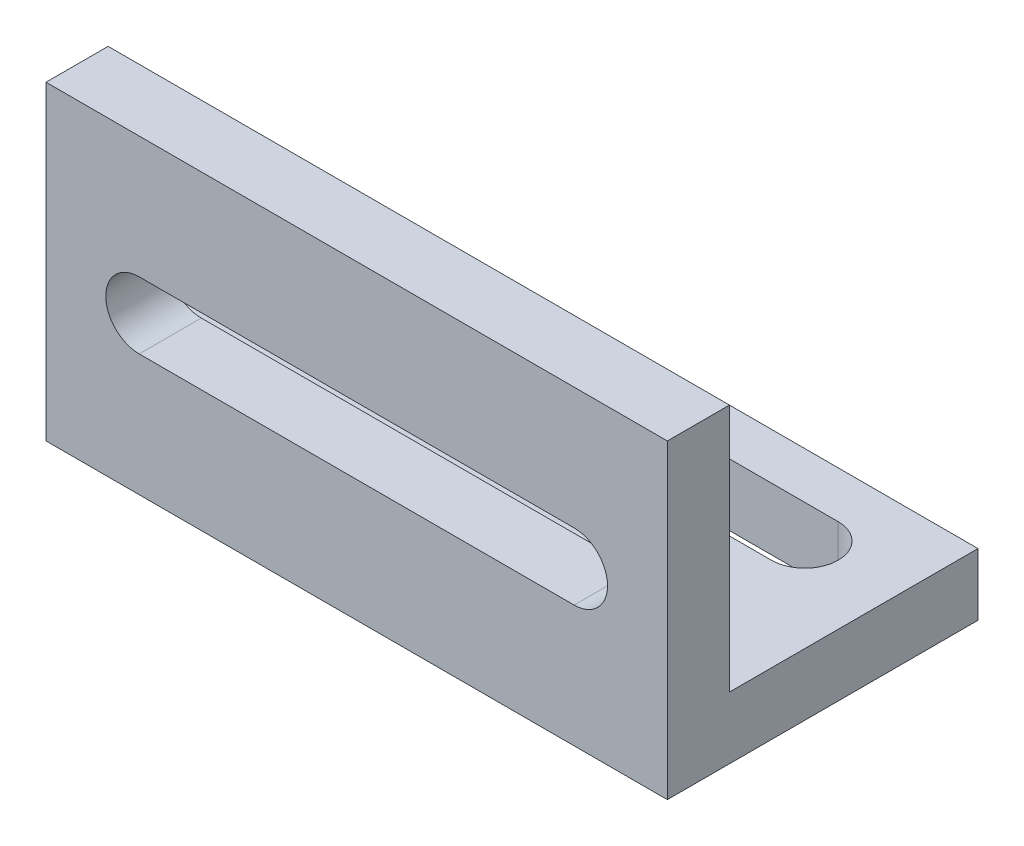
ISO-10303-21;
HEADER;
FILE_DESCRIPTION(('STEP AP214'),'2;1');
FILE_NAME('part.step','',(''),(''),'','','');
FILE_SCHEMA(('AUTOMOTIVE_DESIGN { 1 0 10303 214 1 1 1 1 }'));
ENDSEC;
DATA;
#1=APPLICATION_CONTEXT('core data for automotive mechanical design processes');
#2=APPLICATION_PROTOCOL_DEFINITION('international standard','automotive_design',2000,#1);
#3=PRODUCT_CONTEXT('',#1,'mechanical');
#4=PRODUCT('Part','Part','',(#3));
#5=PRODUCT_RELATED_PRODUCT_CATEGORY('part','',(#4));
#6=PRODUCT_DEFINITION_FORMATION('','',#4);
#7=PRODUCT_DEFINITION_CONTEXT('part definition',#1,'design');
#8=PRODUCT_DEFINITION('design','',#6,#7);
#9=PRODUCT_DEFINITION_SHAPE('','',#8);
#10=(LENGTH_UNIT() NAMED_UNIT(*) SI_UNIT(.MILLI.,.METRE.));
#11=(NAMED_UNIT(*) PLANE_ANGLE_UNIT() SI_UNIT($,.RADIAN.));
#12=(NAMED_UNIT(*) SI_UNIT($,.STERADIAN.) SOLID_ANGLE_UNIT());
#13=UNCERTAINTY_MEASURE_WITH_UNIT(LENGTH_MEASURE(1.E-05),#10,'distance_accuracy_value','');
#14=(GEOMETRIC_REPRESENTATION_CONTEXT(3) GLOBAL_UNCERTAINTY_ASSIGNED_CONTEXT((#13)) GLOBAL_UNIT_ASSIGNED_CONTEXT((#10,
#11,#12)) REPRESENTATION_CONTEXT('',''));
#15=CARTESIAN_POINT('',(0.,0.,0.));
#16=DIRECTION('',(0.,0.,1.));
#17=DIRECTION('',(1.,0.,0.));
#18=AXIS2_PLACEMENT_3D('',#15,#16,#17);
#19=CARTESIAN_POINT('',(-49.2592592592593,4.,0.));
#20=DIRECTION('',(1.,0.,0.));
#21=DIRECTION('',(0.,0.,-1.));
#22=AXIS2_PLACEMENT_3D('',#19,#20,#21);
#23=PLANE('',#22);
#24=DIRECTION('',(0.,0.,1.));
#25=VECTOR('',#24,1.);
#26=CARTESIAN_POINT('',(-49.2592592592593,0.,0.));
#27=LINE('',#26,#25);
#28=CARTESIAN_POINT('',(-49.2592592592593,0.,-12.8888888888889));
#29=VERTEX_POINT('',#28);
#30=CARTESIAN_POINT('',(-49.2592592592593,0.,7.1111111111111));
#31=VERTEX_POINT('',#30);
#32=EDGE_CURVE('E211',#29,#31,#27,.T.);
#33=ORIENTED_EDGE('',*,*,#32,.T.);
#34=DIRECTION('',(0.,-1.,0.));
#35=VECTOR('',#34,1.);
#36=CARTESIAN_POINT('',(-49.2592592592593,4.,7.1111111111111));
#37=LINE('',#36,#35);
#38=CARTESIAN_POINT('',(-49.2592592592593,20.,7.1111111111111));
#39=VERTEX_POINT('',#38);
#40=EDGE_CURVE('E237',#39,#31,#37,.T.);
#41=ORIENTED_EDGE('',*,*,#40,.F.);
#42=DIRECTION('',(0.,0.,1.));
#43=VECTOR('',#42,1.);
#44=CARTESIAN_POINT('',(-49.2592592592593,20.,7.1111111111111));
#45=LINE('',#44,#43);
#46=CARTESIAN_POINT('',(-49.2592592592593,20.,3.1111111111111));
#47=VERTEX_POINT('',#46);
#48=EDGE_CURVE('E193',#47,#39,#45,.T.);
#49=ORIENTED_EDGE('',*,*,#48,.F.);
#50=DIRECTION('',(0.,-1.,0.));
#51=VECTOR('',#50,1.);
#52=CARTESIAN_POINT('',(-49.2592592592593,20.,3.1111111111111));
#53=LINE('',#52,#51);
#54=CARTESIAN_POINT('',(-49.2592592592593,4.,3.1111111111111));
#55=VERTEX_POINT('',#54);
#56=EDGE_CURVE('E203',#47,#55,#53,.T.);
#57=ORIENTED_EDGE('',*,*,#56,.T.);
#58=DIRECTION('',(0.,0.,1.));
#59=VECTOR('',#58,1.);
#60=CARTESIAN_POINT('',(-49.2592592592593,4.,0.));
#61=LINE('',#60,#59);
#62=CARTESIAN_POINT('',(-49.2592592592593,4.,-12.8888888888889));
#63=VERTEX_POINT('',#62);
#64=EDGE_CURVE('E212',#63,#55,#61,.T.);
#65=ORIENTED_EDGE('',*,*,#64,.F.);
#66=DIRECTION('',(0.,-1.,0.));
#67=VECTOR('',#66,1.);
#68=CARTESIAN_POINT('',(-49.2592592592593,4.,-12.8888888888889));
#69=LINE('',#68,#67);
#70=EDGE_CURVE('E221',#63,#29,#69,.T.);
#71=ORIENTED_EDGE('',*,*,#70,.T.);
#72=EDGE_LOOP('',(#33,#41,#49,#57,#65,#71));
#73=FACE_BOUND('',#72,.T.);
#74=ADVANCED_FACE('F35',(#73),#23,.F.);
#75=CARTESIAN_POINT('',(0.,4.,7.1111111111111));
#76=DIRECTION('',(0.,0.,-1.));
#77=DIRECTION('',(-1.,0.,0.));
#78=AXIS2_PLACEMENT_3D('',#75,#76,#77);
#79=PLANE('',#78);
#80=DIRECTION('',(1.,0.,0.));
#81=VECTOR('',#80,1.);
#82=CARTESIAN_POINT('',(0.,12.15,7.1111111111111));
#83=LINE('',#82,#81);
#84=CARTESIAN_POINT('',(-43.2592592592593,12.15,7.1111111111111));
#85=VERTEX_POINT('',#84);
#86=CARTESIAN_POINT('',(-15.2592592592593,12.15,7.1111111111111));
#87=VERTEX_POINT('',#86);
#88=EDGE_CURVE('E166',#85,#87,#83,.T.);
#89=ORIENTED_EDGE('',*,*,#88,.T.);
#90=CARTESIAN_POINT('',(-15.2592592592593,10.,7.1111111111111));
#91=DIRECTION('',(0.,0.,-1.));
#92=DIRECTION('',(-1.,0.,0.));
#93=AXIS2_PLACEMENT_3D('',#90,#91,#92);
#94=CIRCLE('',#93,2.15);
#95=CARTESIAN_POINT('',(-15.2592592592593,7.85,7.1111111111111));
#96=VERTEX_POINT('',#95);
#97=EDGE_CURVE('E169',#87,#96,#94,.T.);
#98=ORIENTED_EDGE('',*,*,#97,.T.);
#99=DIRECTION('',(-1.,0.,0.));
#100=VECTOR('',#99,1.);
#101=CARTESIAN_POINT('',(0.,7.85,7.1111111111111));
#102=LINE('',#101,#100);
#103=CARTESIAN_POINT('',(-43.2592592592593,7.85,7.1111111111111));
#104=VERTEX_POINT('',#103);
#105=EDGE_CURVE('E161',#96,#104,#102,.T.);
#106=ORIENTED_EDGE('',*,*,#105,.T.);
#107=CARTESIAN_POINT('',(-43.2592592592593,10.,7.1111111111111));
#108=DIRECTION('',(0.,0.,-1.));
#109=DIRECTION('',(-1.,0.,0.));
#110=AXIS2_PLACEMENT_3D('',#107,#108,#109);
#111=CIRCLE('',#110,2.15);
#112=EDGE_CURVE('E141',#104,#85,#111,.T.);
#113=ORIENTED_EDGE('',*,*,#112,.T.);
#114=EDGE_LOOP('',(#89,#98,#106,#113));
#115=FACE_BOUND('',#114,.T.);
#116=DIRECTION('',(1.,0.,0.));
#117=VECTOR('',#116,1.);
#118=CARTESIAN_POINT('',(0.,0.,7.1111111111111));
#119=LINE('',#118,#117);
#120=CARTESIAN_POINT('',(-9.25925925925926,0.,7.1111111111111));
#121=VERTEX_POINT('',#120);
#122=EDGE_CURVE('E224',#31,#121,#119,.T.);
#123=ORIENTED_EDGE('',*,*,#122,.T.);
#124=DIRECTION('',(0.,-1.,0.));
#125=VECTOR('',#124,1.);
#126=CARTESIAN_POINT('',(-9.25925925925926,4.,7.1111111111111));
#127=LINE('',#126,#125);
#128=CARTESIAN_POINT('',(-9.25925925925926,20.,7.1111111111111));
#129=VERTEX_POINT('',#128);
#130=EDGE_CURVE('E235',#129,#121,#127,.T.);
#131=ORIENTED_EDGE('',*,*,#130,.F.);
#132=DIRECTION('',(1.,0.,0.));
#133=VECTOR('',#132,1.);
#134=CARTESIAN_POINT('',(-49.2592592592593,20.,7.1111111111111));
#135=LINE('',#134,#133);
#136=EDGE_CURVE('E196',#39,#129,#135,.T.);
#137=ORIENTED_EDGE('',*,*,#136,.F.);
#138=ORIENTED_EDGE('',*,*,#40,.T.);
#139=EDGE_LOOP('',(#123,#131,#137,#138));
#140=FACE_BOUND('',#139,.T.);
#141=ADVANCED_FACE('F280',(#115,#140),#79,.F.);
#142=CARTESIAN_POINT('',(-9.25925925925926,4.,0.));
#143=DIRECTION('',(1.,0.,0.));
#144=DIRECTION('',(0.,0.,-1.));
#145=AXIS2_PLACEMENT_3D('',#142,#143,#144);
#146=PLANE('',#145);
#147=DIRECTION('',(0.,0.,1.));
#148=VECTOR('',#147,1.);
#149=CARTESIAN_POINT('',(-9.25925925925926,0.,0.));
#150=LINE('',#149,#148);
#151=CARTESIAN_POINT('',(-9.25925925925926,0.,-12.8888888888889));
#152=VERTEX_POINT('',#151);
#153=EDGE_CURVE('E227',#152,#121,#150,.T.);
#154=ORIENTED_EDGE('',*,*,#153,.F.);
#155=DIRECTION('',(0.,-1.,0.));
#156=VECTOR('',#155,1.);
#157=CARTESIAN_POINT('',(-9.25925925925926,4.,-12.8888888888889));
#158=LINE('',#157,#156);
#159=CARTESIAN_POINT('',(-9.25925925925926,4.,-12.8888888888889));
#160=VERTEX_POINT('',#159);
#161=EDGE_CURVE('E233',#160,#152,#158,.T.);
#162=ORIENTED_EDGE('',*,*,#161,.F.);
#163=DIRECTION('',(0.,0.,1.));
#164=VECTOR('',#163,1.);
#165=CARTESIAN_POINT('',(-9.25925925925926,4.,0.));
#166=LINE('',#165,#164);
#167=CARTESIAN_POINT('',(-9.25925925925926,4.,3.1111111111111));
#168=VERTEX_POINT('',#167);
#169=EDGE_CURVE('E214',#160,#168,#166,.T.);
#170=ORIENTED_EDGE('',*,*,#169,.T.);
#171=DIRECTION('',(0.,-1.,0.));
#172=VECTOR('',#171,1.);
#173=CARTESIAN_POINT('',(-9.25925925925926,20.,3.1111111111111));
#174=LINE('',#173,#172);
#175=CARTESIAN_POINT('',(-9.25925925925926,20.,3.1111111111111));
#176=VERTEX_POINT('',#175);
#177=EDGE_CURVE('E208',#176,#168,#174,.T.);
#178=ORIENTED_EDGE('',*,*,#177,.F.);
#179=DIRECTION('',(0.,0.,-1.));
#180=VECTOR('',#179,1.);
#181=CARTESIAN_POINT('',(-9.25925925925926,20.,7.1111111111111));
#182=LINE('',#181,#180);
#183=EDGE_CURVE('E199',#129,#176,#182,.T.);
#184=ORIENTED_EDGE('',*,*,#183,.F.);
#185=ORIENTED_EDGE('',*,*,#130,.T.);
#186=EDGE_LOOP('',(#154,#162,#170,#178,#184,#185));
#187=FACE_BOUND('',#186,.T.);
#188=ADVANCED_FACE('F285',(#187),#146,.T.);
#189=CARTESIAN_POINT('',(0.,4.,-12.8888888888889));
#190=DIRECTION('',(0.,0.,-1.));
#191=DIRECTION('',(-1.,0.,0.));
#192=AXIS2_PLACEMENT_3D('',#189,#190,#191);
#193=PLANE('',#192);
#194=DIRECTION('',(1.,0.,0.));
#195=VECTOR('',#194,1.);
#196=CARTESIAN_POINT('',(0.,0.,-12.8888888888889));
#197=LINE('',#196,#195);
#198=EDGE_CURVE('E215',#29,#152,#197,.T.);
#199=ORIENTED_EDGE('',*,*,#198,.F.);
#200=ORIENTED_EDGE('',*,*,#70,.F.);
#201=DIRECTION('',(1.,0.,0.));
#202=VECTOR('',#201,1.);
#203=CARTESIAN_POINT('',(0.,4.,-12.8888888888889));
#204=LINE('',#203,#202);
#205=EDGE_CURVE('E218',#63,#160,#204,.T.);
#206=ORIENTED_EDGE('',*,*,#205,.T.);
#207=ORIENTED_EDGE('',*,*,#161,.T.);
#208=EDGE_LOOP('',(#199,#200,#206,#207));
#209=FACE_BOUND('',#208,.T.);
#210=ADVANCED_FACE('F293',(#209),#193,.T.);
#211=CARTESIAN_POINT('',(0.,4.,0.));
#212=DIRECTION('',(0.,1.,0.));
#213=DIRECTION('',(0.,0.,1.));
#214=AXIS2_PLACEMENT_3D('',#211,#212,#213);
#215=PLANE('',#214);
#216=CARTESIAN_POINT('',(-15.2592592592593,4.,-7.73888888888891));
#217=DIRECTION('',(0.,1.,0.));
#218=DIRECTION('',(0.,0.,1.));
#219=AXIS2_PLACEMENT_3D('',#216,#217,#218);
#220=CIRCLE('',#219,2.15);
#221=CARTESIAN_POINT('',(-15.2592592592593,4.,-5.58888888888891));
#222=VERTEX_POINT('',#221);
#223=CARTESIAN_POINT('',(-15.2592592592593,4.,-9.8888888888889));
#224=VERTEX_POINT('',#223);
#225=EDGE_CURVE('E172',#222,#224,#220,.T.);
#226=ORIENTED_EDGE('',*,*,#225,.F.);
#227=DIRECTION('',(1.,0.,0.));
#228=VECTOR('',#227,1.);
#229=CARTESIAN_POINT('',(-15.2592592592593,4.,-5.58888888888891));
#230=LINE('',#229,#228);
#231=CARTESIAN_POINT('',(-43.2592592592593,4.,-5.58888888888891));
#232=VERTEX_POINT('',#231);
#233=EDGE_CURVE('E180',#232,#222,#230,.T.);
#234=ORIENTED_EDGE('',*,*,#233,.F.);
#235=CARTESIAN_POINT('',(-43.2592592592593,4.,-7.73888888888891));
#236=DIRECTION('',(0.,1.,0.));
#237=DIRECTION('',(0.,0.,1.));
#238=AXIS2_PLACEMENT_3D('',#235,#236,#237);
#239=CIRCLE('',#238,2.14999999999999);
#240=CARTESIAN_POINT('',(-43.2592592592593,4.,-9.8888888888889));
#241=VERTEX_POINT('',#240);
#242=EDGE_CURVE('E177',#241,#232,#239,.T.);
#243=ORIENTED_EDGE('',*,*,#242,.F.);
#244=DIRECTION('',(-1.,0.,0.));
#245=VECTOR('',#244,1.);
#246=CARTESIAN_POINT('',(-15.2592592592593,4.,-9.8888888888889));
#247=LINE('',#246,#245);
#248=EDGE_CURVE('E174',#224,#241,#247,.T.);
#249=ORIENTED_EDGE('',*,*,#248,.F.);
#250=EDGE_LOOP('',(#226,#234,#243,#249));
#251=FACE_BOUND('',#250,.T.);
#252=DIRECTION('',(-1.,0.,0.));
#253=VECTOR('',#252,1.);
#254=CARTESIAN_POINT('',(-49.2592592592593,4.,3.1111111111111));
#255=LINE('',#254,#253);
#256=EDGE_CURVE('E186',#168,#55,#255,.T.);
#257=ORIENTED_EDGE('',*,*,#256,.F.);
#258=ORIENTED_EDGE('',*,*,#169,.F.);
#259=ORIENTED_EDGE('',*,*,#205,.F.);
#260=ORIENTED_EDGE('',*,*,#64,.T.);
#261=EDGE_LOOP('',(#257,#258,#259,#260));
#262=FACE_BOUND('',#261,.T.);
#263=ADVANCED_FACE('F261',(#251,#262),#215,.T.);
#264=CARTESIAN_POINT('',(0.,0.,0.));
#265=DIRECTION('',(0.,1.,0.));
#266=DIRECTION('',(0.,0.,1.));
#267=AXIS2_PLACEMENT_3D('',#264,#265,#266);
#268=PLANE('',#267);
#269=DIRECTION('',(1.,0.,0.));
#270=VECTOR('',#269,1.);
#271=CARTESIAN_POINT('',(0.,0.,-5.58888888888891));
#272=LINE('',#271,#270);
#273=CARTESIAN_POINT('',(-43.2592592592593,0.,-5.58888888888891));
#274=VERTEX_POINT('',#273);
#275=CARTESIAN_POINT('',(-15.2592592592593,0.,-5.58888888888891));
#276=VERTEX_POINT('',#275);
#277=EDGE_CURVE('E42',#274,#276,#272,.T.);
#278=ORIENTED_EDGE('',*,*,#277,.T.);
#279=CARTESIAN_POINT('',(-15.2592592592593,0.,-7.73888888888891));
#280=DIRECTION('',(0.,1.,0.));
#281=DIRECTION('',(0.,0.,1.));
#282=AXIS2_PLACEMENT_3D('',#279,#280,#281);
#283=CIRCLE('',#282,2.15);
#284=CARTESIAN_POINT('',(-15.2592592592593,0.,-9.8888888888889));
#285=VERTEX_POINT('',#284);
#286=EDGE_CURVE('E11',#276,#285,#283,.T.);
#287=ORIENTED_EDGE('',*,*,#286,.T.);
#288=DIRECTION('',(-1.,0.,0.));
#289=VECTOR('',#288,1.);
#290=CARTESIAN_POINT('',(0.,0.,-9.88888888888891));
#291=LINE('',#290,#289);
#292=CARTESIAN_POINT('',(-43.2592592592593,0.,-9.8888888888889));
#293=VERTEX_POINT('',#292);
#294=EDGE_CURVE('E240',#285,#293,#291,.T.);
#295=ORIENTED_EDGE('',*,*,#294,.T.);
#296=CARTESIAN_POINT('',(-43.2592592592593,0.,-7.73888888888891));
#297=DIRECTION('',(0.,1.,0.));
#298=DIRECTION('',(0.,0.,1.));
#299=AXIS2_PLACEMENT_3D('',#296,#297,#298);
#300=CIRCLE('',#299,2.14999999999999);
#301=EDGE_CURVE('E243',#293,#274,#300,.T.);
#302=ORIENTED_EDGE('',*,*,#301,.T.);
#303=EDGE_LOOP('',(#278,#287,#295,#302));
#304=FACE_BOUND('',#303,.T.);
#305=ORIENTED_EDGE('',*,*,#32,.F.);
#306=ORIENTED_EDGE('',*,*,#198,.T.);
#307=ORIENTED_EDGE('',*,*,#153,.T.);
#308=ORIENTED_EDGE('',*,*,#122,.F.);
#309=EDGE_LOOP('',(#305,#306,#307,#308));
#310=FACE_BOUND('',#309,.T.);
#311=ADVANCED_FACE('F247',(#304,#310),#268,.F.);
#312=CARTESIAN_POINT('',(-49.2592592592593,20.,3.1111111111111));
#313=DIRECTION('',(0.,0.,1.));
#314=DIRECTION('',(1.,0.,0.));
#315=AXIS2_PLACEMENT_3D('',#312,#313,#314);
#316=PLANE('',#315);
#317=DIRECTION('',(-1.,0.,0.));
#318=VECTOR('',#317,1.);
#319=CARTESIAN_POINT('',(-15.2592592592593,7.85,3.1111111111111));
#320=LINE('',#319,#318);
#321=CARTESIAN_POINT('',(-15.2592592592593,7.85,3.1111111111111));
#322=VERTEX_POINT('',#321);
#323=CARTESIAN_POINT('',(-43.2592592592593,7.85,3.1111111111111));
#324=VERTEX_POINT('',#323);
#325=EDGE_CURVE('E147',#322,#324,#320,.T.);
#326=ORIENTED_EDGE('',*,*,#325,.F.);
#327=CARTESIAN_POINT('',(-15.2592592592593,10.,3.1111111111111));
#328=DIRECTION('',(0.,0.,-1.));
#329=DIRECTION('',(-1.,0.,0.));
#330=AXIS2_PLACEMENT_3D('',#327,#328,#329);
#331=CIRCLE('',#330,2.15);
#332=CARTESIAN_POINT('',(-15.2592592592593,12.15,3.1111111111111));
#333=VERTEX_POINT('',#332);
#334=EDGE_CURVE('E57',#333,#322,#331,.T.);
#335=ORIENTED_EDGE('',*,*,#334,.F.);
#336=DIRECTION('',(1.,0.,0.));
#337=VECTOR('',#336,1.);
#338=CARTESIAN_POINT('',(-15.2592592592593,12.15,3.1111111111111));
#339=LINE('',#338,#337);
#340=CARTESIAN_POINT('',(-43.2592592592593,12.15,3.1111111111111));
#341=VERTEX_POINT('',#340);
#342=EDGE_CURVE('E154',#341,#333,#339,.T.);
#343=ORIENTED_EDGE('',*,*,#342,.F.);
#344=CARTESIAN_POINT('',(-43.2592592592593,10.,3.1111111111111));
#345=DIRECTION('',(0.,0.,-1.));
#346=DIRECTION('',(-1.,0.,0.));
#347=AXIS2_PLACEMENT_3D('',#344,#345,#346);
#348=CIRCLE('',#347,2.15);
#349=EDGE_CURVE('E138',#324,#341,#348,.T.);
#350=ORIENTED_EDGE('',*,*,#349,.F.);
#351=EDGE_LOOP('',(#326,#335,#343,#350));
#352=FACE_BOUND('',#351,.T.);
#353=ORIENTED_EDGE('',*,*,#256,.T.);
#354=ORIENTED_EDGE('',*,*,#56,.F.);
#355=DIRECTION('',(-1.,0.,0.));
#356=VECTOR('',#355,1.);
#357=CARTESIAN_POINT('',(-49.2592592592593,20.,3.1111111111111));
#358=LINE('',#357,#356);
#359=EDGE_CURVE('E201',#176,#47,#358,.T.);
#360=ORIENTED_EDGE('',*,*,#359,.F.);
#361=ORIENTED_EDGE('',*,*,#177,.T.);
#362=EDGE_LOOP('',(#353,#354,#360,#361));
#363=FACE_BOUND('',#362,.T.);
#364=ADVANCED_FACE('F151',(#352,#363),#316,.F.);
#365=CARTESIAN_POINT('',(0.,20.,0.));
#366=DIRECTION('',(0.,-1.,0.));
#367=DIRECTION('',(0.,0.,-1.));
#368=AXIS2_PLACEMENT_3D('',#365,#366,#367);
#369=PLANE('',#368);
#370=ORIENTED_EDGE('',*,*,#48,.T.);
#371=ORIENTED_EDGE('',*,*,#136,.T.);
#372=ORIENTED_EDGE('',*,*,#183,.T.);
#373=ORIENTED_EDGE('',*,*,#359,.T.);
#374=EDGE_LOOP('',(#370,#371,#372,#373));
#375=FACE_BOUND('',#374,.T.);
#376=ADVANCED_FACE('F302',(#375),#369,.F.);
#377=CARTESIAN_POINT('',(-15.2592592592593,-6.,-7.73888888888891));
#378=DIRECTION('',(0.,1.,0.));
#379=DIRECTION('',(0.,0.,1.));
#380=AXIS2_PLACEMENT_3D('',#377,#378,#379);
#381=CYLINDRICAL_SURFACE('',#380,2.15);
#382=DIRECTION('',(0.,1.,0.));
#383=VECTOR('',#382,1.);
#384=CARTESIAN_POINT('',(-15.2592592592593,-6.,-5.58888888888891));
#385=LINE('',#384,#383);
#386=EDGE_CURVE('E184',#276,#222,#385,.T.);
#387=ORIENTED_EDGE('',*,*,#386,.T.);
#388=ORIENTED_EDGE('',*,*,#225,.T.);
#389=DIRECTION('',(0.,1.,0.));
#390=VECTOR('',#389,1.);
#391=CARTESIAN_POINT('',(-15.2592592592593,-6.,-9.8888888888889));
#392=LINE('',#391,#390);
#393=EDGE_CURVE('E183',#285,#224,#392,.T.);
#394=ORIENTED_EDGE('',*,*,#393,.F.);
#395=ORIENTED_EDGE('',*,*,#286,.F.);
#396=EDGE_LOOP('',(#387,#388,#394,#395));
#397=FACE_BOUND('',#396,.T.);
#398=ADVANCED_FACE('F265',(#397),#381,.F.);
#399=CARTESIAN_POINT('',(-15.2592592592593,-6.,-5.58888888888891));
#400=DIRECTION('',(0.,0.,1.));
#401=DIRECTION('',(1.,0.,0.));
#402=AXIS2_PLACEMENT_3D('',#399,#400,#401);
#403=PLANE('',#402);
#404=DIRECTION('',(0.,1.,0.));
#405=VECTOR('',#404,1.);
#406=CARTESIAN_POINT('',(-43.2592592592593,-6.,-5.58888888888891));
#407=LINE('',#406,#405);
#408=EDGE_CURVE('E187',#274,#232,#407,.T.);
#409=ORIENTED_EDGE('',*,*,#408,.T.);
#410=ORIENTED_EDGE('',*,*,#233,.T.);
#411=ORIENTED_EDGE('',*,*,#386,.F.);
#412=ORIENTED_EDGE('',*,*,#277,.F.);
#413=EDGE_LOOP('',(#409,#410,#411,#412));
#414=FACE_BOUND('',#413,.T.);
#415=ADVANCED_FACE('F253',(#414),#403,.F.);
#416=CARTESIAN_POINT('',(-43.2592592592593,-6.,-7.73888888888891));
#417=DIRECTION('',(0.,1.,0.));
#418=DIRECTION('',(0.,0.,1.));
#419=AXIS2_PLACEMENT_3D('',#416,#417,#418);
#420=CYLINDRICAL_SURFACE('',#419,2.14999999999999);
#421=DIRECTION('',(0.,1.,0.));
#422=VECTOR('',#421,1.);
#423=CARTESIAN_POINT('',(-43.2592592592593,-6.,-9.8888888888889));
#424=LINE('',#423,#422);
#425=EDGE_CURVE('E189',#293,#241,#424,.T.);
#426=ORIENTED_EDGE('',*,*,#425,.T.);
#427=ORIENTED_EDGE('',*,*,#242,.T.);
#428=ORIENTED_EDGE('',*,*,#408,.F.);
#429=ORIENTED_EDGE('',*,*,#301,.F.);
#430=EDGE_LOOP('',(#426,#427,#428,#429));
#431=FACE_BOUND('',#430,.T.);
#432=ADVANCED_FACE('F255',(#431),#420,.F.);
#433=CARTESIAN_POINT('',(-15.2592592592593,-6.,-9.8888888888889));
#434=DIRECTION('',(0.,0.,-1.));
#435=DIRECTION('',(-1.,0.,0.));
#436=AXIS2_PLACEMENT_3D('',#433,#434,#435);
#437=PLANE('',#436);
#438=ORIENTED_EDGE('',*,*,#393,.T.);
#439=ORIENTED_EDGE('',*,*,#248,.T.);
#440=ORIENTED_EDGE('',*,*,#425,.F.);
#441=ORIENTED_EDGE('',*,*,#294,.F.);
#442=EDGE_LOOP('',(#438,#439,#440,#441));
#443=FACE_BOUND('',#442,.T.);
#444=ADVANCED_FACE('F267',(#443),#437,.F.);
#445=CARTESIAN_POINT('',(-15.2592592592593,10.,13.1111111111111));
#446=DIRECTION('',(0.,0.,-1.));
#447=DIRECTION('',(-1.,0.,0.));
#448=AXIS2_PLACEMENT_3D('',#445,#446,#447);
#449=CYLINDRICAL_SURFACE('',#448,2.15);
#450=DIRECTION('',(0.,0.,-1.));
#451=VECTOR('',#450,1.);
#452=CARTESIAN_POINT('',(-15.2592592592593,12.15,13.1111111111111));
#453=LINE('',#452,#451);
#454=EDGE_CURVE('E159',#87,#333,#453,.T.);
#455=ORIENTED_EDGE('',*,*,#454,.T.);
#456=ORIENTED_EDGE('',*,*,#334,.T.);
#457=DIRECTION('',(0.,0.,-1.));
#458=VECTOR('',#457,1.);
#459=CARTESIAN_POINT('',(-15.2592592592593,7.85,13.1111111111111));
#460=LINE('',#459,#458);
#461=EDGE_CURVE('E144',#96,#322,#460,.T.);
#462=ORIENTED_EDGE('',*,*,#461,.F.);
#463=ORIENTED_EDGE('',*,*,#97,.F.);
#464=EDGE_LOOP('',(#455,#456,#462,#463));
#465=FACE_BOUND('',#464,.T.);
#466=ADVANCED_FACE('F269',(#465),#449,.F.);
#467=CARTESIAN_POINT('',(-15.2592592592593,12.15,13.1111111111111));
#468=DIRECTION('',(0.,1.,0.));
#469=DIRECTION('',(0.,0.,1.));
#470=AXIS2_PLACEMENT_3D('',#467,#468,#469);
#471=PLANE('',#470);
#472=DIRECTION('',(0.,0.,-1.));
#473=VECTOR('',#472,1.);
#474=CARTESIAN_POINT('',(-43.2592592592593,12.15,13.1111111111111));
#475=LINE('',#474,#473);
#476=EDGE_CURVE('E143',#85,#341,#475,.T.);
#477=ORIENTED_EDGE('',*,*,#476,.T.);
#478=ORIENTED_EDGE('',*,*,#342,.T.);
#479=ORIENTED_EDGE('',*,*,#454,.F.);
#480=ORIENTED_EDGE('',*,*,#88,.F.);
#481=EDGE_LOOP('',(#477,#478,#479,#480));
#482=FACE_BOUND('',#481,.T.);
#483=ADVANCED_FACE('F275',(#482),#471,.F.);
#484=CARTESIAN_POINT('',(-43.2592592592593,10.,13.1111111111111));
#485=DIRECTION('',(0.,0.,-1.));
#486=DIRECTION('',(-1.,0.,0.));
#487=AXIS2_PLACEMENT_3D('',#484,#485,#486);
#488=CYLINDRICAL_SURFACE('',#487,2.15);
#489=DIRECTION('',(0.,0.,-1.));
#490=VECTOR('',#489,1.);
#491=CARTESIAN_POINT('',(-43.2592592592593,7.85,13.1111111111111));
#492=LINE('',#491,#490);
#493=EDGE_CURVE('E49',#104,#324,#492,.T.);
#494=ORIENTED_EDGE('',*,*,#493,.T.);
#495=ORIENTED_EDGE('',*,*,#349,.T.);
#496=ORIENTED_EDGE('',*,*,#476,.F.);
#497=ORIENTED_EDGE('',*,*,#112,.F.);
#498=EDGE_LOOP('',(#494,#495,#496,#497));
#499=FACE_BOUND('',#498,.T.);
#500=ADVANCED_FACE('F135',(#499),#488,.F.);
#501=CARTESIAN_POINT('',(-15.2592592592593,7.85,13.1111111111111));
#502=DIRECTION('',(0.,-1.,0.));
#503=DIRECTION('',(0.,0.,-1.));
#504=AXIS2_PLACEMENT_3D('',#501,#502,#503);
#505=PLANE('',#504);
#506=ORIENTED_EDGE('',*,*,#461,.T.);
#507=ORIENTED_EDGE('',*,*,#325,.T.);
#508=ORIENTED_EDGE('',*,*,#493,.F.);
#509=ORIENTED_EDGE('',*,*,#105,.F.);
#510=EDGE_LOOP('',(#506,#507,#508,#509));
#511=FACE_BOUND('',#510,.T.);
#512=ADVANCED_FACE('F148',(#511),#505,.F.);
#513=CLOSED_SHELL('',(#74,#141,#188,#210,#263,#311,#364,#376,#398,#415,#432,#444,#466,#483,#500,#512));
#514=MANIFOLD_SOLID_BREP('B2',#513);
#515=ADVANCED_BREP_SHAPE_REPRESENTATION('',(#18,#514),#14);
#516=SHAPE_DEFINITION_REPRESENTATION(#9,#515);
ENDSEC;
END-ISO-10303-21;
